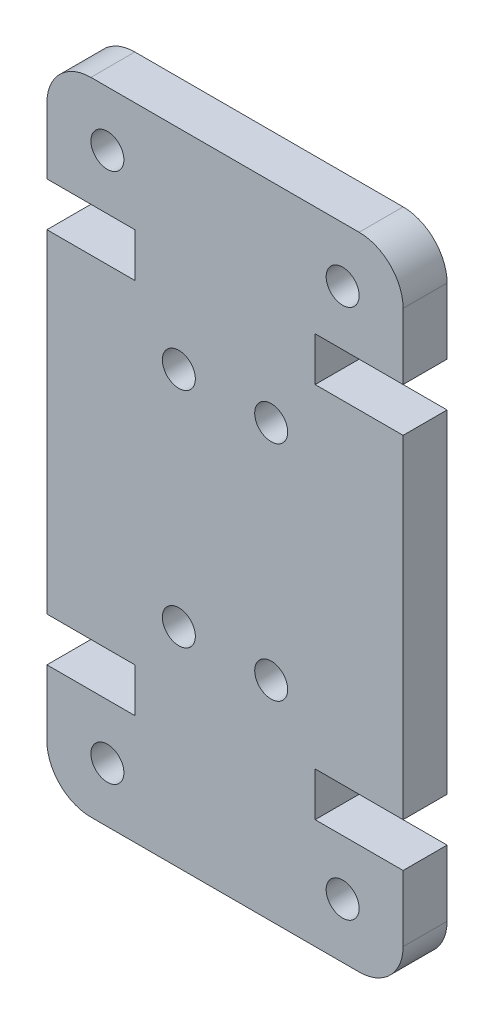
ISO-10303-21;
HEADER;
FILE_DESCRIPTION(('STEP AP214'),'2;1');
FILE_NAME('part.step','',(''),(''),'','','');
FILE_SCHEMA(('AUTOMOTIVE_DESIGN { 1 0 10303 214 1 1 1 1 }'));
ENDSEC;
DATA;
#1=APPLICATION_CONTEXT('core data for automotive mechanical design processes');
#2=APPLICATION_PROTOCOL_DEFINITION('international standard','automotive_design',2000,#1);
#3=PRODUCT_CONTEXT('',#1,'mechanical');
#4=PRODUCT('Part','Part','',(#3));
#5=PRODUCT_RELATED_PRODUCT_CATEGORY('part','',(#4));
#6=PRODUCT_DEFINITION_FORMATION('','',#4);
#7=PRODUCT_DEFINITION_CONTEXT('part definition',#1,'design');
#8=PRODUCT_DEFINITION('design','',#6,#7);
#9=PRODUCT_DEFINITION_SHAPE('','',#8);
#10=(LENGTH_UNIT() NAMED_UNIT(*) SI_UNIT(.MILLI.,.METRE.));
#11=(NAMED_UNIT(*) PLANE_ANGLE_UNIT() SI_UNIT($,.RADIAN.));
#12=(NAMED_UNIT(*) SI_UNIT($,.STERADIAN.) SOLID_ANGLE_UNIT());
#13=UNCERTAINTY_MEASURE_WITH_UNIT(LENGTH_MEASURE(1.E-05),#10,'distance_accuracy_value','');
#14=(GEOMETRIC_REPRESENTATION_CONTEXT(3) GLOBAL_UNCERTAINTY_ASSIGNED_CONTEXT((#13)) GLOBAL_UNIT_ASSIGNED_CONTEXT((#10,
#11,#12)) REPRESENTATION_CONTEXT('',''));
#15=CARTESIAN_POINT('',(0.,0.,0.));
#16=DIRECTION('',(0.,0.,1.));
#17=DIRECTION('',(1.,0.,0.));
#18=AXIS2_PLACEMENT_3D('',#15,#16,#17);
#19=CARTESIAN_POINT('',(2.00000000000002,2.,2.));
#20=DIRECTION('',(0.,0.,1.));
#21=DIRECTION('',(1.,0.,0.));
#22=AXIS2_PLACEMENT_3D('',#19,#20,#21);
#23=PLANE('',#22);
#24=CARTESIAN_POINT('',(10.2,19.6400000000004,2.));
#25=DIRECTION('',(0.,0.,1.));
#26=DIRECTION('',(1.,0.,0.));
#27=AXIS2_PLACEMENT_3D('',#24,#25,#26);
#28=CIRCLE('',#27,0.750000000000002);
#29=CARTESIAN_POINT('',(10.95,19.6400000000004,2.));
#30=VERTEX_POINT('',#29);
#31=EDGE_CURVE('E464',#30,#30,#28,.T.);
#32=ORIENTED_EDGE('',*,*,#31,.F.);
#33=EDGE_LOOP('',(#32));
#34=FACE_BOUND('',#33,.T.);
#35=CARTESIAN_POINT('',(6.,19.6400000000004,2.));
#36=DIRECTION('',(0.,0.,1.));
#37=DIRECTION('',(-1.,0.,0.));
#38=AXIS2_PLACEMENT_3D('',#35,#36,#37);
#39=CIRCLE('',#38,0.750000000000001);
#40=CARTESIAN_POINT('',(5.25,19.6400000000004,2.));
#41=VERTEX_POINT('',#40);
#42=EDGE_CURVE('E476',#41,#41,#39,.T.);
#43=ORIENTED_EDGE('',*,*,#42,.F.);
#44=EDGE_LOOP('',(#43));
#45=FACE_BOUND('',#44,.T.);
#46=CARTESIAN_POINT('',(2.75000000000004,26.6399999999998,2.));
#47=DIRECTION('',(0.,0.,1.));
#48=DIRECTION('',(-1.,0.,0.));
#49=AXIS2_PLACEMENT_3D('',#46,#47,#48);
#50=CIRCLE('',#49,0.750000000000001);
#51=CARTESIAN_POINT('',(2.00000000000004,26.6399999999998,2.));
#52=VERTEX_POINT('',#51);
#53=EDGE_CURVE('E488',#52,#52,#50,.T.);
#54=ORIENTED_EDGE('',*,*,#53,.F.);
#55=EDGE_LOOP('',(#54));
#56=FACE_BOUND('',#55,.T.);
#57=CARTESIAN_POINT('',(13.45,2.50000000000017,2.));
#58=DIRECTION('',(0.,0.,1.));
#59=DIRECTION('',(-1.,0.,0.));
#60=AXIS2_PLACEMENT_3D('',#57,#58,#59);
#61=CIRCLE('',#60,0.750000000000002);
#62=CARTESIAN_POINT('',(12.7,2.50000000000017,2.));
#63=VERTEX_POINT('',#62);
#64=EDGE_CURVE('E230',#63,#63,#61,.T.);
#65=ORIENTED_EDGE('',*,*,#64,.F.);
#66=EDGE_LOOP('',(#65));
#67=FACE_BOUND('',#66,.T.);
#68=DIRECTION('',(1.,0.,0.));
#69=VECTOR('',#68,1.);
#70=CARTESIAN_POINT('',(0.,6.99999999999946,2.));
#71=LINE('',#70,#69);
#72=CARTESIAN_POINT('',(0.,6.99999999999946,2.));
#73=VERTEX_POINT('',#72);
#74=CARTESIAN_POINT('',(4.00000000000002,6.99999999999946,2.));
#75=VERTEX_POINT('',#74);
#76=EDGE_CURVE('E273',#73,#75,#71,.T.);
#77=ORIENTED_EDGE('',*,*,#76,.T.);
#78=DIRECTION('',(0.,-1.,0.));
#79=VECTOR('',#78,1.);
#80=CARTESIAN_POINT('',(4.00000000000002,6.99999999999946,2.));
#81=LINE('',#80,#79);
#82=CARTESIAN_POINT('',(4.,4.99999999999945,2.));
#83=VERTEX_POINT('',#82);
#84=EDGE_CURVE('E141',#75,#83,#81,.T.);
#85=ORIENTED_EDGE('',*,*,#84,.T.);
#86=DIRECTION('',(-1.,0.,0.));
#87=VECTOR('',#86,1.);
#88=CARTESIAN_POINT('',(4.,4.99999999999945,2.));
#89=LINE('',#88,#87);
#90=CARTESIAN_POINT('',(0.,4.99999999999945,2.));
#91=VERTEX_POINT('',#90);
#92=EDGE_CURVE('E336',#83,#91,#89,.T.);
#93=ORIENTED_EDGE('',*,*,#92,.T.);
#94=DIRECTION('',(0.,-1.,0.));
#95=VECTOR('',#94,1.);
#96=CARTESIAN_POINT('',(0.,2.,2.));
#97=LINE('',#96,#95);
#98=CARTESIAN_POINT('',(0.,2.,2.));
#99=VERTEX_POINT('',#98);
#100=EDGE_CURVE('E355',#91,#99,#97,.T.);
#101=ORIENTED_EDGE('',*,*,#100,.T.);
#102=CARTESIAN_POINT('',(2.00000000000002,2.,2.));
#103=DIRECTION('',(0.,0.,1.));
#104=DIRECTION('',(1.,0.,0.));
#105=AXIS2_PLACEMENT_3D('',#102,#103,#104);
#106=CIRCLE('',#105,2.00000000000001);
#107=CARTESIAN_POINT('',(2.00000000000002,0.,2.));
#108=VERTEX_POINT('',#107);
#109=EDGE_CURVE('E352',#99,#108,#106,.T.);
#110=ORIENTED_EDGE('',*,*,#109,.T.);
#111=DIRECTION('',(1.,0.,0.));
#112=VECTOR('',#111,1.);
#113=CARTESIAN_POINT('',(2.00000000000002,0.,2.));
#114=LINE('',#113,#112);
#115=CARTESIAN_POINT('',(14.2,0.,2.));
#116=VERTEX_POINT('',#115);
#117=EDGE_CURVE('E354',#108,#116,#114,.T.);
#118=ORIENTED_EDGE('',*,*,#117,.T.);
#119=CARTESIAN_POINT('',(14.2,2.,2.));
#120=DIRECTION('',(0.,0.,1.));
#121=DIRECTION('',(-1.,0.,0.));
#122=AXIS2_PLACEMENT_3D('',#119,#120,#121);
#123=CIRCLE('',#122,2.);
#124=CARTESIAN_POINT('',(16.2,2.,2.));
#125=VERTEX_POINT('',#124);
#126=EDGE_CURVE('E357',#116,#125,#123,.T.);
#127=ORIENTED_EDGE('',*,*,#126,.T.);
#128=DIRECTION('',(0.,1.,0.));
#129=VECTOR('',#128,1.);
#130=CARTESIAN_POINT('',(16.2,2.,2.));
#131=LINE('',#130,#129);
#132=CARTESIAN_POINT('',(16.2,4.99999999999945,2.));
#133=VERTEX_POINT('',#132);
#134=EDGE_CURVE('E363',#125,#133,#131,.T.);
#135=ORIENTED_EDGE('',*,*,#134,.T.);
#136=DIRECTION('',(-1.,0.,0.));
#137=VECTOR('',#136,1.);
#138=CARTESIAN_POINT('',(12.2,4.99999999999945,2.));
#139=LINE('',#138,#137);
#140=CARTESIAN_POINT('',(12.2,4.99999999999945,2.));
#141=VERTEX_POINT('',#140);
#142=EDGE_CURVE('E365',#133,#141,#139,.T.);
#143=ORIENTED_EDGE('',*,*,#142,.T.);
#144=DIRECTION('',(0.,1.,0.));
#145=VECTOR('',#144,1.);
#146=CARTESIAN_POINT('',(12.2,6.99999999999945,2.));
#147=LINE('',#146,#145);
#148=CARTESIAN_POINT('',(12.2,6.99999999999945,2.));
#149=VERTEX_POINT('',#148);
#150=EDGE_CURVE('E367',#141,#149,#147,.T.);
#151=ORIENTED_EDGE('',*,*,#150,.T.);
#152=DIRECTION('',(1.,0.,0.));
#153=VECTOR('',#152,1.);
#154=CARTESIAN_POINT('',(16.2,6.99999999999945,2.));
#155=LINE('',#154,#153);
#156=CARTESIAN_POINT('',(16.2,6.99999999999945,2.));
#157=VERTEX_POINT('',#156);
#158=EDGE_CURVE('E369',#149,#157,#155,.T.);
#159=ORIENTED_EDGE('',*,*,#158,.T.);
#160=DIRECTION('',(0.,1.,0.));
#161=VECTOR('',#160,1.);
#162=CARTESIAN_POINT('',(16.2,22.1400000000005,2.));
#163=LINE('',#162,#161);
#164=CARTESIAN_POINT('',(16.2,22.1400000000005,2.));
#165=VERTEX_POINT('',#164);
#166=EDGE_CURVE('E371',#157,#165,#163,.T.);
#167=ORIENTED_EDGE('',*,*,#166,.T.);
#168=DIRECTION('',(-1.,0.,0.));
#169=VECTOR('',#168,1.);
#170=CARTESIAN_POINT('',(16.2,22.1400000000005,2.));
#171=LINE('',#170,#169);
#172=CARTESIAN_POINT('',(12.2,22.1400000000005,2.));
#173=VERTEX_POINT('',#172);
#174=EDGE_CURVE('E373',#165,#173,#171,.T.);
#175=ORIENTED_EDGE('',*,*,#174,.T.);
#176=DIRECTION('',(0.,1.,0.));
#177=VECTOR('',#176,1.);
#178=CARTESIAN_POINT('',(12.2,22.1400000000005,2.));
#179=LINE('',#178,#177);
#180=CARTESIAN_POINT('',(12.2,24.1400000000006,2.));
#181=VERTEX_POINT('',#180);
#182=EDGE_CURVE('E375',#173,#181,#179,.T.);
#183=ORIENTED_EDGE('',*,*,#182,.T.);
#184=DIRECTION('',(1.,0.,0.));
#185=VECTOR('',#184,1.);
#186=CARTESIAN_POINT('',(12.2,24.1400000000006,2.));
#187=LINE('',#186,#185);
#188=CARTESIAN_POINT('',(16.2,24.1400000000006,2.));
#189=VERTEX_POINT('',#188);
#190=EDGE_CURVE('E377',#181,#189,#187,.T.);
#191=ORIENTED_EDGE('',*,*,#190,.T.);
#192=DIRECTION('',(0.,1.,0.));
#193=VECTOR('',#192,1.);
#194=CARTESIAN_POINT('',(16.2,27.14,2.));
#195=LINE('',#194,#193);
#196=CARTESIAN_POINT('',(16.2,27.14,2.));
#197=VERTEX_POINT('',#196);
#198=EDGE_CURVE('E379',#189,#197,#195,.T.);
#199=ORIENTED_EDGE('',*,*,#198,.T.);
#200=CARTESIAN_POINT('',(14.2,27.14,2.));
#201=DIRECTION('',(0.,0.,1.));
#202=DIRECTION('',(1.,0.,0.));
#203=AXIS2_PLACEMENT_3D('',#200,#201,#202);
#204=CIRCLE('',#203,2.);
#205=CARTESIAN_POINT('',(14.2,29.14,2.));
#206=VERTEX_POINT('',#205);
#207=EDGE_CURVE('E381',#197,#206,#204,.T.);
#208=ORIENTED_EDGE('',*,*,#207,.T.);
#209=DIRECTION('',(-1.,0.,0.));
#210=VECTOR('',#209,1.);
#211=CARTESIAN_POINT('',(1.99999999999999,29.14,2.));
#212=LINE('',#211,#210);
#213=CARTESIAN_POINT('',(1.99999999999999,29.14,2.));
#214=VERTEX_POINT('',#213);
#215=EDGE_CURVE('E383',#206,#214,#212,.T.);
#216=ORIENTED_EDGE('',*,*,#215,.T.);
#217=CARTESIAN_POINT('',(2.,27.14,2.));
#218=DIRECTION('',(0.,0.,1.));
#219=DIRECTION('',(-1.,0.,0.));
#220=AXIS2_PLACEMENT_3D('',#217,#218,#219);
#221=CIRCLE('',#220,2.);
#222=CARTESIAN_POINT('',(0.,27.14,2.));
#223=VERTEX_POINT('',#222);
#224=EDGE_CURVE('E385',#214,#223,#221,.T.);
#225=ORIENTED_EDGE('',*,*,#224,.T.);
#226=DIRECTION('',(0.,-1.,0.));
#227=VECTOR('',#226,1.);
#228=CARTESIAN_POINT('',(0.,27.14,2.));
#229=LINE('',#228,#227);
#230=CARTESIAN_POINT('',(0.,24.1400000000005,2.));
#231=VERTEX_POINT('',#230);
#232=EDGE_CURVE('E387',#223,#231,#229,.T.);
#233=ORIENTED_EDGE('',*,*,#232,.T.);
#234=DIRECTION('',(1.,0.,0.));
#235=VECTOR('',#234,1.);
#236=CARTESIAN_POINT('',(3.99999999999999,24.1400000000006,2.));
#237=LINE('',#236,#235);
#238=CARTESIAN_POINT('',(3.99999999999999,24.1400000000006,2.));
#239=VERTEX_POINT('',#238);
#240=EDGE_CURVE('E208',#231,#239,#237,.T.);
#241=ORIENTED_EDGE('',*,*,#240,.T.);
#242=DIRECTION('',(0.,-1.,0.));
#243=VECTOR('',#242,1.);
#244=CARTESIAN_POINT('',(4.,22.1400000000005,2.));
#245=LINE('',#244,#243);
#246=CARTESIAN_POINT('',(4.,22.1400000000005,2.));
#247=VERTEX_POINT('',#246);
#248=EDGE_CURVE('E202',#239,#247,#245,.T.);
#249=ORIENTED_EDGE('',*,*,#248,.T.);
#250=DIRECTION('',(-1.,0.,0.));
#251=VECTOR('',#250,1.);
#252=CARTESIAN_POINT('',(0.,22.1400000000005,2.));
#253=LINE('',#252,#251);
#254=CARTESIAN_POINT('',(0.,22.1400000000005,2.));
#255=VERTEX_POINT('',#254);
#256=EDGE_CURVE('E206',#247,#255,#253,.T.);
#257=ORIENTED_EDGE('',*,*,#256,.T.);
#258=DIRECTION('',(0.,-1.,0.));
#259=VECTOR('',#258,1.);
#260=CARTESIAN_POINT('',(0.,22.1400000000005,2.));
#261=LINE('',#260,#259);
#262=EDGE_CURVE('E50',#255,#73,#261,.T.);
#263=ORIENTED_EDGE('',*,*,#262,.T.);
#264=EDGE_LOOP('',(#77,#85,#93,#101,#110,#118,#127,#135,#143,#151,#159,#167,#175,#183,#191,#199,
#208,#216,#225,#233,#241,#249,#257,#263));
#265=FACE_BOUND('',#264,.T.);
#266=CARTESIAN_POINT('',(10.2,9.49999999999962,2.));
#267=DIRECTION('',(0.,0.,1.));
#268=DIRECTION('',(-1.,0.,0.));
#269=AXIS2_PLACEMENT_3D('',#266,#267,#268);
#270=CIRCLE('',#269,0.750000000000002);
#271=CARTESIAN_POINT('',(9.44999999999999,9.49999999999962,2.));
#272=VERTEX_POINT('',#271);
#273=EDGE_CURVE('E494',#272,#272,#270,.T.);
#274=ORIENTED_EDGE('',*,*,#273,.F.);
#275=EDGE_LOOP('',(#274));
#276=FACE_BOUND('',#275,.T.);
#277=CARTESIAN_POINT('',(6.00000000000001,9.49999999999962,2.));
#278=DIRECTION('',(0.,0.,1.));
#279=DIRECTION('',(1.,0.,0.));
#280=AXIS2_PLACEMENT_3D('',#277,#278,#279);
#281=CIRCLE('',#280,0.75);
#282=CARTESIAN_POINT('',(6.75000000000001,9.49999999999962,2.));
#283=VERTEX_POINT('',#282);
#284=EDGE_CURVE('E482',#283,#283,#281,.T.);
#285=ORIENTED_EDGE('',*,*,#284,.F.);
#286=EDGE_LOOP('',(#285));
#287=FACE_BOUND('',#286,.T.);
#288=CARTESIAN_POINT('',(2.75000000000004,2.50000000000017,2.));
#289=DIRECTION('',(0.,0.,1.));
#290=DIRECTION('',(1.,0.,0.));
#291=AXIS2_PLACEMENT_3D('',#288,#289,#290);
#292=CIRCLE('',#291,0.75);
#293=CARTESIAN_POINT('',(3.50000000000004,2.50000000000017,2.));
#294=VERTEX_POINT('',#293);
#295=EDGE_CURVE('E470',#294,#294,#292,.T.);
#296=ORIENTED_EDGE('',*,*,#295,.F.);
#297=EDGE_LOOP('',(#296));
#298=FACE_BOUND('',#297,.T.);
#299=CARTESIAN_POINT('',(13.45,26.6399999999998,2.));
#300=DIRECTION('',(0.,0.,1.));
#301=DIRECTION('',(1.,0.,0.));
#302=AXIS2_PLACEMENT_3D('',#299,#300,#301);
#303=CIRCLE('',#302,0.750000000000002);
#304=CARTESIAN_POINT('',(14.2,26.6399999999998,2.));
#305=VERTEX_POINT('',#304);
#306=EDGE_CURVE('E455',#305,#305,#303,.T.);
#307=ORIENTED_EDGE('',*,*,#306,.F.);
#308=EDGE_LOOP('',(#307));
#309=FACE_BOUND('',#308,.T.);
#310=ADVANCED_FACE('F33',(#34,#45,#56,#67,#265,#276,#287,#298,#309),#23,.T.);
#311=CARTESIAN_POINT('',(2.00000000000002,2.,0.));
#312=DIRECTION('',(0.,0.,1.));
#313=DIRECTION('',(1.,0.,0.));
#314=AXIS2_PLACEMENT_3D('',#311,#312,#313);
#315=PLANE('',#314);
#316=CARTESIAN_POINT('',(10.2,19.6400000000004,0.));
#317=DIRECTION('',(0.,0.,1.));
#318=DIRECTION('',(1.,0.,0.));
#319=AXIS2_PLACEMENT_3D('',#316,#317,#318);
#320=CIRCLE('',#319,0.750000000000002);
#321=CARTESIAN_POINT('',(10.95,19.6400000000004,0.));
#322=VERTEX_POINT('',#321);
#323=EDGE_CURVE('E461',#322,#322,#320,.T.);
#324=ORIENTED_EDGE('',*,*,#323,.T.);
#325=EDGE_LOOP('',(#324));
#326=FACE_BOUND('',#325,.T.);
#327=CARTESIAN_POINT('',(6.,19.6400000000004,0.));
#328=DIRECTION('',(0.,0.,1.));
#329=DIRECTION('',(-1.,0.,0.));
#330=AXIS2_PLACEMENT_3D('',#327,#328,#329);
#331=CIRCLE('',#330,0.750000000000001);
#332=CARTESIAN_POINT('',(5.25,19.6400000000004,0.));
#333=VERTEX_POINT('',#332);
#334=EDGE_CURVE('E473',#333,#333,#331,.T.);
#335=ORIENTED_EDGE('',*,*,#334,.T.);
#336=EDGE_LOOP('',(#335));
#337=FACE_BOUND('',#336,.T.);
#338=CARTESIAN_POINT('',(2.75000000000004,26.6399999999998,0.));
#339=DIRECTION('',(0.,0.,1.));
#340=DIRECTION('',(-1.,0.,0.));
#341=AXIS2_PLACEMENT_3D('',#338,#339,#340);
#342=CIRCLE('',#341,0.750000000000001);
#343=CARTESIAN_POINT('',(2.00000000000004,26.6399999999998,0.));
#344=VERTEX_POINT('',#343);
#345=EDGE_CURVE('E485',#344,#344,#342,.T.);
#346=ORIENTED_EDGE('',*,*,#345,.T.);
#347=EDGE_LOOP('',(#346));
#348=FACE_BOUND('',#347,.T.);
#349=CARTESIAN_POINT('',(13.45,2.50000000000017,0.));
#350=DIRECTION('',(0.,0.,1.));
#351=DIRECTION('',(-1.,0.,0.));
#352=AXIS2_PLACEMENT_3D('',#349,#350,#351);
#353=CIRCLE('',#352,0.750000000000002);
#354=CARTESIAN_POINT('',(12.7,2.50000000000017,0.));
#355=VERTEX_POINT('',#354);
#356=EDGE_CURVE('E497',#355,#355,#353,.T.);
#357=ORIENTED_EDGE('',*,*,#356,.T.);
#358=EDGE_LOOP('',(#357));
#359=FACE_BOUND('',#358,.T.);
#360=DIRECTION('',(1.,0.,0.));
#361=VECTOR('',#360,1.);
#362=CARTESIAN_POINT('',(0.,6.99999999999946,0.));
#363=LINE('',#362,#361);
#364=CARTESIAN_POINT('',(0.,6.99999999999946,0.));
#365=VERTEX_POINT('',#364);
#366=CARTESIAN_POINT('',(4.00000000000002,6.99999999999946,0.));
#367=VERTEX_POINT('',#366);
#368=EDGE_CURVE('E226',#365,#367,#363,.T.);
#369=ORIENTED_EDGE('',*,*,#368,.F.);
#370=DIRECTION('',(0.,-1.,0.));
#371=VECTOR('',#370,1.);
#372=CARTESIAN_POINT('',(0.,22.1400000000005,0.));
#373=LINE('',#372,#371);
#374=CARTESIAN_POINT('',(0.,22.1400000000005,0.));
#375=VERTEX_POINT('',#374);
#376=EDGE_CURVE('E133',#375,#365,#373,.T.);
#377=ORIENTED_EDGE('',*,*,#376,.F.);
#378=DIRECTION('',(-1.,0.,0.));
#379=VECTOR('',#378,1.);
#380=CARTESIAN_POINT('',(0.,22.1400000000005,0.));
#381=LINE('',#380,#379);
#382=CARTESIAN_POINT('',(4.,22.1400000000005,0.));
#383=VERTEX_POINT('',#382);
#384=EDGE_CURVE('E127',#383,#375,#381,.T.);
#385=ORIENTED_EDGE('',*,*,#384,.F.);
#386=DIRECTION('',(0.,-1.,0.));
#387=VECTOR('',#386,1.);
#388=CARTESIAN_POINT('',(4.,22.1400000000005,0.));
#389=LINE('',#388,#387);
#390=CARTESIAN_POINT('',(3.99999999999999,24.1400000000006,0.));
#391=VERTEX_POINT('',#390);
#392=EDGE_CURVE('E216',#391,#383,#389,.T.);
#393=ORIENTED_EDGE('',*,*,#392,.F.);
#394=DIRECTION('',(1.,0.,0.));
#395=VECTOR('',#394,1.);
#396=CARTESIAN_POINT('',(3.99999999999999,24.1400000000006,0.));
#397=LINE('',#396,#395);
#398=CARTESIAN_POINT('',(0.,24.1400000000005,0.));
#399=VERTEX_POINT('',#398);
#400=EDGE_CURVE('E268',#399,#391,#397,.T.);
#401=ORIENTED_EDGE('',*,*,#400,.F.);
#402=DIRECTION('',(0.,-1.,0.));
#403=VECTOR('',#402,1.);
#404=CARTESIAN_POINT('',(0.,27.14,0.));
#405=LINE('',#404,#403);
#406=CARTESIAN_POINT('',(0.,27.14,0.));
#407=VERTEX_POINT('',#406);
#408=EDGE_CURVE('E266',#407,#399,#405,.T.);
#409=ORIENTED_EDGE('',*,*,#408,.F.);
#410=CARTESIAN_POINT('',(2.,27.14,0.));
#411=DIRECTION('',(0.,0.,1.));
#412=DIRECTION('',(-1.,0.,0.));
#413=AXIS2_PLACEMENT_3D('',#410,#411,#412);
#414=CIRCLE('',#413,2.);
#415=CARTESIAN_POINT('',(1.99999999999999,29.14,0.));
#416=VERTEX_POINT('',#415);
#417=EDGE_CURVE('E264',#416,#407,#414,.T.);
#418=ORIENTED_EDGE('',*,*,#417,.F.);
#419=DIRECTION('',(-1.,0.,0.));
#420=VECTOR('',#419,1.);
#421=CARTESIAN_POINT('',(1.99999999999999,29.14,0.));
#422=LINE('',#421,#420);
#423=CARTESIAN_POINT('',(14.2,29.14,0.));
#424=VERTEX_POINT('',#423);
#425=EDGE_CURVE('E262',#424,#416,#422,.T.);
#426=ORIENTED_EDGE('',*,*,#425,.F.);
#427=CARTESIAN_POINT('',(14.2,27.14,0.));
#428=DIRECTION('',(0.,0.,1.));
#429=DIRECTION('',(1.,0.,0.));
#430=AXIS2_PLACEMENT_3D('',#427,#428,#429);
#431=CIRCLE('',#430,2.);
#432=CARTESIAN_POINT('',(16.2,27.14,0.));
#433=VERTEX_POINT('',#432);
#434=EDGE_CURVE('E260',#433,#424,#431,.T.);
#435=ORIENTED_EDGE('',*,*,#434,.F.);
#436=DIRECTION('',(0.,1.,0.));
#437=VECTOR('',#436,1.);
#438=CARTESIAN_POINT('',(16.2,27.14,0.));
#439=LINE('',#438,#437);
#440=CARTESIAN_POINT('',(16.2,24.1400000000006,0.));
#441=VERTEX_POINT('',#440);
#442=EDGE_CURVE('E258',#441,#433,#439,.T.);
#443=ORIENTED_EDGE('',*,*,#442,.F.);
#444=DIRECTION('',(1.,0.,0.));
#445=VECTOR('',#444,1.);
#446=CARTESIAN_POINT('',(12.2,24.1400000000006,0.));
#447=LINE('',#446,#445);
#448=CARTESIAN_POINT('',(12.2,24.1400000000006,0.));
#449=VERTEX_POINT('',#448);
#450=EDGE_CURVE('E256',#449,#441,#447,.T.);
#451=ORIENTED_EDGE('',*,*,#450,.F.);
#452=DIRECTION('',(0.,1.,0.));
#453=VECTOR('',#452,1.);
#454=CARTESIAN_POINT('',(12.2,22.1400000000005,0.));
#455=LINE('',#454,#453);
#456=CARTESIAN_POINT('',(12.2,22.1400000000005,0.));
#457=VERTEX_POINT('',#456);
#458=EDGE_CURVE('E254',#457,#449,#455,.T.);
#459=ORIENTED_EDGE('',*,*,#458,.F.);
#460=DIRECTION('',(-1.,0.,0.));
#461=VECTOR('',#460,1.);
#462=CARTESIAN_POINT('',(16.2,22.1400000000005,0.));
#463=LINE('',#462,#461);
#464=CARTESIAN_POINT('',(16.2,22.1400000000005,0.));
#465=VERTEX_POINT('',#464);
#466=EDGE_CURVE('E252',#465,#457,#463,.T.);
#467=ORIENTED_EDGE('',*,*,#466,.F.);
#468=DIRECTION('',(0.,1.,0.));
#469=VECTOR('',#468,1.);
#470=CARTESIAN_POINT('',(16.2,22.1400000000005,0.));
#471=LINE('',#470,#469);
#472=CARTESIAN_POINT('',(16.2,6.99999999999945,0.));
#473=VERTEX_POINT('',#472);
#474=EDGE_CURVE('E250',#473,#465,#471,.T.);
#475=ORIENTED_EDGE('',*,*,#474,.F.);
#476=DIRECTION('',(1.,0.,0.));
#477=VECTOR('',#476,1.);
#478=CARTESIAN_POINT('',(16.2,6.99999999999945,0.));
#479=LINE('',#478,#477);
#480=CARTESIAN_POINT('',(12.2,6.99999999999945,0.));
#481=VERTEX_POINT('',#480);
#482=EDGE_CURVE('E248',#481,#473,#479,.T.);
#483=ORIENTED_EDGE('',*,*,#482,.F.);
#484=DIRECTION('',(0.,1.,0.));
#485=VECTOR('',#484,1.);
#486=CARTESIAN_POINT('',(12.2,6.99999999999945,0.));
#487=LINE('',#486,#485);
#488=CARTESIAN_POINT('',(12.2,4.99999999999945,0.));
#489=VERTEX_POINT('',#488);
#490=EDGE_CURVE('E246',#489,#481,#487,.T.);
#491=ORIENTED_EDGE('',*,*,#490,.F.);
#492=DIRECTION('',(-1.,0.,0.));
#493=VECTOR('',#492,1.);
#494=CARTESIAN_POINT('',(12.2,4.99999999999945,0.));
#495=LINE('',#494,#493);
#496=CARTESIAN_POINT('',(16.2,4.99999999999945,0.));
#497=VERTEX_POINT('',#496);
#498=EDGE_CURVE('E244',#497,#489,#495,.T.);
#499=ORIENTED_EDGE('',*,*,#498,.F.);
#500=DIRECTION('',(0.,1.,0.));
#501=VECTOR('',#500,1.);
#502=CARTESIAN_POINT('',(16.2,2.,0.));
#503=LINE('',#502,#501);
#504=CARTESIAN_POINT('',(16.2,2.,0.));
#505=VERTEX_POINT('',#504);
#506=EDGE_CURVE('E242',#505,#497,#503,.T.);
#507=ORIENTED_EDGE('',*,*,#506,.F.);
#508=CARTESIAN_POINT('',(14.2,2.,0.));
#509=DIRECTION('',(0.,0.,1.));
#510=DIRECTION('',(-1.,0.,0.));
#511=AXIS2_PLACEMENT_3D('',#508,#509,#510);
#512=CIRCLE('',#511,2.);
#513=CARTESIAN_POINT('',(14.2,0.,0.));
#514=VERTEX_POINT('',#513);
#515=EDGE_CURVE('E240',#514,#505,#512,.T.);
#516=ORIENTED_EDGE('',*,*,#515,.F.);
#517=DIRECTION('',(1.,0.,0.));
#518=VECTOR('',#517,1.);
#519=CARTESIAN_POINT('',(2.00000000000002,0.,0.));
#520=LINE('',#519,#518);
#521=CARTESIAN_POINT('',(2.00000000000002,0.,0.));
#522=VERTEX_POINT('',#521);
#523=EDGE_CURVE('E238',#522,#514,#520,.T.);
#524=ORIENTED_EDGE('',*,*,#523,.F.);
#525=CARTESIAN_POINT('',(2.00000000000002,2.,0.));
#526=DIRECTION('',(0.,0.,1.));
#527=DIRECTION('',(1.,0.,0.));
#528=AXIS2_PLACEMENT_3D('',#525,#526,#527);
#529=CIRCLE('',#528,2.00000000000001);
#530=CARTESIAN_POINT('',(0.,2.,0.));
#531=VERTEX_POINT('',#530);
#532=EDGE_CURVE('E236',#531,#522,#529,.T.);
#533=ORIENTED_EDGE('',*,*,#532,.F.);
#534=DIRECTION('',(0.,-1.,0.));
#535=VECTOR('',#534,1.);
#536=CARTESIAN_POINT('',(0.,2.,0.));
#537=LINE('',#536,#535);
#538=CARTESIAN_POINT('',(0.,4.99999999999945,0.));
#539=VERTEX_POINT('',#538);
#540=EDGE_CURVE('E234',#539,#531,#537,.T.);
#541=ORIENTED_EDGE('',*,*,#540,.F.);
#542=DIRECTION('',(-1.,0.,0.));
#543=VECTOR('',#542,1.);
#544=CARTESIAN_POINT('',(4.,4.99999999999945,0.));
#545=LINE('',#544,#543);
#546=CARTESIAN_POINT('',(4.,4.99999999999945,0.));
#547=VERTEX_POINT('',#546);
#548=EDGE_CURVE('E232',#547,#539,#545,.T.);
#549=ORIENTED_EDGE('',*,*,#548,.F.);
#550=DIRECTION('',(0.,-1.,0.));
#551=VECTOR('',#550,1.);
#552=CARTESIAN_POINT('',(4.00000000000002,6.99999999999946,0.));
#553=LINE('',#552,#551);
#554=EDGE_CURVE('E229',#367,#547,#553,.T.);
#555=ORIENTED_EDGE('',*,*,#554,.F.);
#556=EDGE_LOOP('',(#369,#377,#385,#393,#401,#409,#418,#426,#435,#443,#451,#459,#467,#475,#483,
#491,#499,#507,#516,#524,#533,#541,#549,#555));
#557=FACE_BOUND('',#556,.T.);
#558=CARTESIAN_POINT('',(10.2,9.49999999999962,0.));
#559=DIRECTION('',(0.,0.,1.));
#560=DIRECTION('',(-1.,0.,0.));
#561=AXIS2_PLACEMENT_3D('',#558,#559,#560);
#562=CIRCLE('',#561,0.750000000000002);
#563=CARTESIAN_POINT('',(9.44999999999999,9.49999999999962,0.));
#564=VERTEX_POINT('',#563);
#565=EDGE_CURVE('E491',#564,#564,#562,.T.);
#566=ORIENTED_EDGE('',*,*,#565,.T.);
#567=EDGE_LOOP('',(#566));
#568=FACE_BOUND('',#567,.T.);
#569=CARTESIAN_POINT('',(6.00000000000001,9.49999999999962,0.));
#570=DIRECTION('',(0.,0.,1.));
#571=DIRECTION('',(1.,0.,0.));
#572=AXIS2_PLACEMENT_3D('',#569,#570,#571);
#573=CIRCLE('',#572,0.75);
#574=CARTESIAN_POINT('',(6.75000000000001,9.49999999999962,0.));
#575=VERTEX_POINT('',#574);
#576=EDGE_CURVE('E479',#575,#575,#573,.T.);
#577=ORIENTED_EDGE('',*,*,#576,.T.);
#578=EDGE_LOOP('',(#577));
#579=FACE_BOUND('',#578,.T.);
#580=CARTESIAN_POINT('',(2.75000000000004,2.50000000000017,0.));
#581=DIRECTION('',(0.,0.,1.));
#582=DIRECTION('',(1.,0.,0.));
#583=AXIS2_PLACEMENT_3D('',#580,#581,#582);
#584=CIRCLE('',#583,0.75);
#585=CARTESIAN_POINT('',(3.50000000000004,2.50000000000017,0.));
#586=VERTEX_POINT('',#585);
#587=EDGE_CURVE('E467',#586,#586,#584,.T.);
#588=ORIENTED_EDGE('',*,*,#587,.T.);
#589=EDGE_LOOP('',(#588));
#590=FACE_BOUND('',#589,.T.);
#591=CARTESIAN_POINT('',(13.45,26.6399999999998,0.));
#592=DIRECTION('',(0.,0.,1.));
#593=DIRECTION('',(1.,0.,0.));
#594=AXIS2_PLACEMENT_3D('',#591,#592,#593);
#595=CIRCLE('',#594,0.750000000000002);
#596=CARTESIAN_POINT('',(14.2,26.6399999999998,0.));
#597=VERTEX_POINT('',#596);
#598=EDGE_CURVE('E458',#597,#597,#595,.T.);
#599=ORIENTED_EDGE('',*,*,#598,.T.);
#600=EDGE_LOOP('',(#599));
#601=FACE_BOUND('',#600,.T.);
#602=ADVANCED_FACE('F340',(#326,#337,#348,#359,#557,#568,#579,#590,#601),#315,.F.);
#603=CARTESIAN_POINT('',(0.,6.99999999999946,2.));
#604=DIRECTION('',(0.,1.,0.));
#605=DIRECTION('',(0.,0.,1.));
#606=AXIS2_PLACEMENT_3D('',#603,#604,#605);
#607=PLANE('',#606);
#608=ORIENTED_EDGE('',*,*,#368,.T.);
#609=DIRECTION('',(0.,0.,-1.));
#610=VECTOR('',#609,1.);
#611=CARTESIAN_POINT('',(4.00000000000002,6.99999999999946,2.));
#612=LINE('',#611,#610);
#613=EDGE_CURVE('E11',#75,#367,#612,.T.);
#614=ORIENTED_EDGE('',*,*,#613,.F.);
#615=ORIENTED_EDGE('',*,*,#76,.F.);
#616=DIRECTION('',(0.,0.,-1.));
#617=VECTOR('',#616,1.);
#618=CARTESIAN_POINT('',(0.,6.99999999999946,2.));
#619=LINE('',#618,#617);
#620=EDGE_CURVE('E222',#73,#365,#619,.T.);
#621=ORIENTED_EDGE('',*,*,#620,.T.);
#622=EDGE_LOOP('',(#608,#614,#615,#621));
#623=FACE_BOUND('',#622,.T.);
#624=ADVANCED_FACE('F35',(#623),#607,.F.);
#625=CARTESIAN_POINT('',(4.00000000000002,6.99999999999946,2.));
#626=DIRECTION('',(1.,0.,0.));
#627=DIRECTION('',(0.,1.,0.));
#628=AXIS2_PLACEMENT_3D('',#625,#626,#627);
#629=PLANE('',#628);
#630=ORIENTED_EDGE('',*,*,#554,.T.);
#631=DIRECTION('',(0.,0.,-1.));
#632=VECTOR('',#631,1.);
#633=CARTESIAN_POINT('',(4.,4.99999999999945,2.));
#634=LINE('',#633,#632);
#635=EDGE_CURVE('E42',#83,#547,#634,.T.);
#636=ORIENTED_EDGE('',*,*,#635,.F.);
#637=ORIENTED_EDGE('',*,*,#84,.F.);
#638=ORIENTED_EDGE('',*,*,#613,.T.);
#639=EDGE_LOOP('',(#630,#636,#637,#638));
#640=FACE_BOUND('',#639,.T.);
#641=ADVANCED_FACE('F762',(#640),#629,.F.);
#642=CARTESIAN_POINT('',(4.,4.99999999999945,2.));
#643=DIRECTION('',(0.,-1.,0.));
#644=DIRECTION('',(0.,0.,-1.));
#645=AXIS2_PLACEMENT_3D('',#642,#643,#644);
#646=PLANE('',#645);
#647=ORIENTED_EDGE('',*,*,#548,.T.);
#648=DIRECTION('',(0.,0.,-1.));
#649=VECTOR('',#648,1.);
#650=CARTESIAN_POINT('',(0.,4.99999999999945,2.));
#651=LINE('',#650,#649);
#652=EDGE_CURVE('E328',#91,#539,#651,.T.);
#653=ORIENTED_EDGE('',*,*,#652,.F.);
#654=ORIENTED_EDGE('',*,*,#92,.F.);
#655=ORIENTED_EDGE('',*,*,#635,.T.);
#656=EDGE_LOOP('',(#647,#653,#654,#655));
#657=FACE_BOUND('',#656,.T.);
#658=ADVANCED_FACE('F334',(#657),#646,.F.);
#659=CARTESIAN_POINT('',(0.,2.,2.));
#660=DIRECTION('',(1.,0.,0.));
#661=DIRECTION('',(0.,0.,-1.));
#662=AXIS2_PLACEMENT_3D('',#659,#660,#661);
#663=PLANE('',#662);
#664=ORIENTED_EDGE('',*,*,#540,.T.);
#665=DIRECTION('',(0.,0.,-1.));
#666=VECTOR('',#665,1.);
#667=CARTESIAN_POINT('',(0.,2.,2.));
#668=LINE('',#667,#666);
#669=EDGE_CURVE('E325',#99,#531,#668,.T.);
#670=ORIENTED_EDGE('',*,*,#669,.F.);
#671=ORIENTED_EDGE('',*,*,#100,.F.);
#672=ORIENTED_EDGE('',*,*,#652,.T.);
#673=EDGE_LOOP('',(#664,#670,#671,#672));
#674=FACE_BOUND('',#673,.T.);
#675=ADVANCED_FACE('F346',(#674),#663,.F.);
#676=CARTESIAN_POINT('',(2.00000000000002,2.,2.));
#677=DIRECTION('',(0.,0.,-1.));
#678=DIRECTION('',(-1.,0.,0.));
#679=AXIS2_PLACEMENT_3D('',#676,#677,#678);
#680=CYLINDRICAL_SURFACE('',#679,2.00000000000001);
#681=ORIENTED_EDGE('',*,*,#532,.T.);
#682=DIRECTION('',(0.,0.,-1.));
#683=VECTOR('',#682,1.);
#684=CARTESIAN_POINT('',(2.00000000000002,0.,2.));
#685=LINE('',#684,#683);
#686=EDGE_CURVE('E322',#108,#522,#685,.T.);
#687=ORIENTED_EDGE('',*,*,#686,.F.);
#688=ORIENTED_EDGE('',*,*,#109,.F.);
#689=ORIENTED_EDGE('',*,*,#669,.T.);
#690=EDGE_LOOP('',(#681,#687,#688,#689));
#691=FACE_BOUND('',#690,.T.);
#692=ADVANCED_FACE('F350',(#691),#680,.T.);
#693=CARTESIAN_POINT('',(2.00000000000002,0.,2.));
#694=DIRECTION('',(0.,1.,0.));
#695=DIRECTION('',(-1.,0.,0.));
#696=AXIS2_PLACEMENT_3D('',#693,#694,#695);
#697=PLANE('',#696);
#698=ORIENTED_EDGE('',*,*,#523,.T.);
#699=DIRECTION('',(0.,0.,-1.));
#700=VECTOR('',#699,1.);
#701=CARTESIAN_POINT('',(14.2,0.,2.));
#702=LINE('',#701,#700);
#703=EDGE_CURVE('E319',#116,#514,#702,.T.);
#704=ORIENTED_EDGE('',*,*,#703,.F.);
#705=ORIENTED_EDGE('',*,*,#117,.F.);
#706=ORIENTED_EDGE('',*,*,#686,.T.);
#707=EDGE_LOOP('',(#698,#704,#705,#706));
#708=FACE_BOUND('',#707,.T.);
#709=ADVANCED_FACE('F727',(#708),#697,.F.);
#710=CARTESIAN_POINT('',(14.2,2.,2.));
#711=DIRECTION('',(0.,0.,-1.));
#712=DIRECTION('',(-1.,0.,0.));
#713=AXIS2_PLACEMENT_3D('',#710,#711,#712);
#714=CYLINDRICAL_SURFACE('',#713,2.);
#715=ORIENTED_EDGE('',*,*,#515,.T.);
#716=DIRECTION('',(0.,0.,-1.));
#717=VECTOR('',#716,1.);
#718=CARTESIAN_POINT('',(16.2,2.,2.));
#719=LINE('',#718,#717);
#720=EDGE_CURVE('E316',#125,#505,#719,.T.);
#721=ORIENTED_EDGE('',*,*,#720,.F.);
#722=ORIENTED_EDGE('',*,*,#126,.F.);
#723=ORIENTED_EDGE('',*,*,#703,.T.);
#724=EDGE_LOOP('',(#715,#721,#722,#723));
#725=FACE_BOUND('',#724,.T.);
#726=ADVANCED_FACE('F717',(#725),#714,.T.);
#727=CARTESIAN_POINT('',(16.2,2.,2.));
#728=DIRECTION('',(-1.,0.,0.));
#729=DIRECTION('',(0.,0.,1.));
#730=AXIS2_PLACEMENT_3D('',#727,#728,#729);
#731=PLANE('',#730);
#732=ORIENTED_EDGE('',*,*,#506,.T.);
#733=DIRECTION('',(0.,0.,-1.));
#734=VECTOR('',#733,1.);
#735=CARTESIAN_POINT('',(16.2,4.99999999999945,2.));
#736=LINE('',#735,#734);
#737=EDGE_CURVE('E313',#133,#497,#736,.T.);
#738=ORIENTED_EDGE('',*,*,#737,.F.);
#739=ORIENTED_EDGE('',*,*,#134,.F.);
#740=ORIENTED_EDGE('',*,*,#720,.T.);
#741=EDGE_LOOP('',(#732,#738,#739,#740));
#742=FACE_BOUND('',#741,.T.);
#743=ADVANCED_FACE('F707',(#742),#731,.F.);
#744=CARTESIAN_POINT('',(12.2,4.99999999999945,2.));
#745=DIRECTION('',(0.,-1.,0.));
#746=DIRECTION('',(0.,0.,-1.));
#747=AXIS2_PLACEMENT_3D('',#744,#745,#746);
#748=PLANE('',#747);
#749=ORIENTED_EDGE('',*,*,#498,.T.);
#750=DIRECTION('',(0.,0.,-1.));
#751=VECTOR('',#750,1.);
#752=CARTESIAN_POINT('',(12.2,4.99999999999945,2.));
#753=LINE('',#752,#751);
#754=EDGE_CURVE('E310',#141,#489,#753,.T.);
#755=ORIENTED_EDGE('',*,*,#754,.F.);
#756=ORIENTED_EDGE('',*,*,#142,.F.);
#757=ORIENTED_EDGE('',*,*,#737,.T.);
#758=EDGE_LOOP('',(#749,#755,#756,#757));
#759=FACE_BOUND('',#758,.T.);
#760=ADVANCED_FACE('F697',(#759),#748,.F.);
#761=CARTESIAN_POINT('',(12.2,6.99999999999945,2.));
#762=DIRECTION('',(-1.,0.,0.));
#763=DIRECTION('',(0.,0.,1.));
#764=AXIS2_PLACEMENT_3D('',#761,#762,#763);
#765=PLANE('',#764);
#766=ORIENTED_EDGE('',*,*,#490,.T.);
#767=DIRECTION('',(0.,0.,-1.));
#768=VECTOR('',#767,1.);
#769=CARTESIAN_POINT('',(12.2,6.99999999999945,2.));
#770=LINE('',#769,#768);
#771=EDGE_CURVE('E307',#149,#481,#770,.T.);
#772=ORIENTED_EDGE('',*,*,#771,.F.);
#773=ORIENTED_EDGE('',*,*,#150,.F.);
#774=ORIENTED_EDGE('',*,*,#754,.T.);
#775=EDGE_LOOP('',(#766,#772,#773,#774));
#776=FACE_BOUND('',#775,.T.);
#777=ADVANCED_FACE('F687',(#776),#765,.F.);
#778=CARTESIAN_POINT('',(16.2,6.99999999999945,2.));
#779=DIRECTION('',(0.,1.,0.));
#780=DIRECTION('',(-1.,0.,0.));
#781=AXIS2_PLACEMENT_3D('',#778,#779,#780);
#782=PLANE('',#781);
#783=ORIENTED_EDGE('',*,*,#482,.T.);
#784=DIRECTION('',(0.,0.,-1.));
#785=VECTOR('',#784,1.);
#786=CARTESIAN_POINT('',(16.2,6.99999999999945,2.));
#787=LINE('',#786,#785);
#788=EDGE_CURVE('E304',#157,#473,#787,.T.);
#789=ORIENTED_EDGE('',*,*,#788,.F.);
#790=ORIENTED_EDGE('',*,*,#158,.F.);
#791=ORIENTED_EDGE('',*,*,#771,.T.);
#792=EDGE_LOOP('',(#783,#789,#790,#791));
#793=FACE_BOUND('',#792,.T.);
#794=ADVANCED_FACE('F677',(#793),#782,.F.);
#795=CARTESIAN_POINT('',(16.2,22.1400000000005,2.));
#796=DIRECTION('',(-1.,0.,0.));
#797=DIRECTION('',(0.,0.,1.));
#798=AXIS2_PLACEMENT_3D('',#795,#796,#797);
#799=PLANE('',#798);
#800=ORIENTED_EDGE('',*,*,#474,.T.);
#801=DIRECTION('',(0.,0.,-1.));
#802=VECTOR('',#801,1.);
#803=CARTESIAN_POINT('',(16.2,22.1400000000005,2.));
#804=LINE('',#803,#802);
#805=EDGE_CURVE('E301',#165,#465,#804,.T.);
#806=ORIENTED_EDGE('',*,*,#805,.F.);
#807=ORIENTED_EDGE('',*,*,#166,.F.);
#808=ORIENTED_EDGE('',*,*,#788,.T.);
#809=EDGE_LOOP('',(#800,#806,#807,#808));
#810=FACE_BOUND('',#809,.T.);
#811=ADVANCED_FACE('F667',(#810),#799,.F.);
#812=CARTESIAN_POINT('',(16.2,22.1400000000005,2.));
#813=DIRECTION('',(0.,-1.,0.));
#814=DIRECTION('',(0.,0.,-1.));
#815=AXIS2_PLACEMENT_3D('',#812,#813,#814);
#816=PLANE('',#815);
#817=ORIENTED_EDGE('',*,*,#466,.T.);
#818=DIRECTION('',(0.,0.,-1.));
#819=VECTOR('',#818,1.);
#820=CARTESIAN_POINT('',(12.2,22.1400000000005,2.));
#821=LINE('',#820,#819);
#822=EDGE_CURVE('E298',#173,#457,#821,.T.);
#823=ORIENTED_EDGE('',*,*,#822,.F.);
#824=ORIENTED_EDGE('',*,*,#174,.F.);
#825=ORIENTED_EDGE('',*,*,#805,.T.);
#826=EDGE_LOOP('',(#817,#823,#824,#825));
#827=FACE_BOUND('',#826,.T.);
#828=ADVANCED_FACE('F657',(#827),#816,.F.);
#829=CARTESIAN_POINT('',(12.2,22.1400000000005,2.));
#830=DIRECTION('',(-1.,0.,0.));
#831=DIRECTION('',(0.,0.,1.));
#832=AXIS2_PLACEMENT_3D('',#829,#830,#831);
#833=PLANE('',#832);
#834=ORIENTED_EDGE('',*,*,#458,.T.);
#835=DIRECTION('',(0.,0.,-1.));
#836=VECTOR('',#835,1.);
#837=CARTESIAN_POINT('',(12.2,24.1400000000006,2.));
#838=LINE('',#837,#836);
#839=EDGE_CURVE('E295',#181,#449,#838,.T.);
#840=ORIENTED_EDGE('',*,*,#839,.F.);
#841=ORIENTED_EDGE('',*,*,#182,.F.);
#842=ORIENTED_EDGE('',*,*,#822,.T.);
#843=EDGE_LOOP('',(#834,#840,#841,#842));
#844=FACE_BOUND('',#843,.T.);
#845=ADVANCED_FACE('F647',(#844),#833,.F.);
#846=CARTESIAN_POINT('',(12.2,24.1400000000006,2.));
#847=DIRECTION('',(0.,1.,0.));
#848=DIRECTION('',(0.,0.,1.));
#849=AXIS2_PLACEMENT_3D('',#846,#847,#848);
#850=PLANE('',#849);
#851=ORIENTED_EDGE('',*,*,#450,.T.);
#852=DIRECTION('',(0.,0.,-1.));
#853=VECTOR('',#852,1.);
#854=CARTESIAN_POINT('',(16.2,24.1400000000006,2.));
#855=LINE('',#854,#853);
#856=EDGE_CURVE('E292',#189,#441,#855,.T.);
#857=ORIENTED_EDGE('',*,*,#856,.F.);
#858=ORIENTED_EDGE('',*,*,#190,.F.);
#859=ORIENTED_EDGE('',*,*,#839,.T.);
#860=EDGE_LOOP('',(#851,#857,#858,#859));
#861=FACE_BOUND('',#860,.T.);
#862=ADVANCED_FACE('F637',(#861),#850,.F.);
#863=CARTESIAN_POINT('',(16.2,27.14,2.));
#864=DIRECTION('',(-1.,0.,0.));
#865=DIRECTION('',(0.,0.,1.));
#866=AXIS2_PLACEMENT_3D('',#863,#864,#865);
#867=PLANE('',#866);
#868=ORIENTED_EDGE('',*,*,#442,.T.);
#869=DIRECTION('',(0.,0.,-1.));
#870=VECTOR('',#869,1.);
#871=CARTESIAN_POINT('',(16.2,27.14,2.));
#872=LINE('',#871,#870);
#873=EDGE_CURVE('E289',#197,#433,#872,.T.);
#874=ORIENTED_EDGE('',*,*,#873,.F.);
#875=ORIENTED_EDGE('',*,*,#198,.F.);
#876=ORIENTED_EDGE('',*,*,#856,.T.);
#877=EDGE_LOOP('',(#868,#874,#875,#876));
#878=FACE_BOUND('',#877,.T.);
#879=ADVANCED_FACE('F627',(#878),#867,.F.);
#880=CARTESIAN_POINT('',(14.2,27.14,2.));
#881=DIRECTION('',(0.,0.,-1.));
#882=DIRECTION('',(-1.,0.,0.));
#883=AXIS2_PLACEMENT_3D('',#880,#881,#882);
#884=CYLINDRICAL_SURFACE('',#883,2.);
#885=ORIENTED_EDGE('',*,*,#434,.T.);
#886=DIRECTION('',(0.,0.,-1.));
#887=VECTOR('',#886,1.);
#888=CARTESIAN_POINT('',(14.2,29.14,2.));
#889=LINE('',#888,#887);
#890=EDGE_CURVE('E286',#206,#424,#889,.T.);
#891=ORIENTED_EDGE('',*,*,#890,.F.);
#892=ORIENTED_EDGE('',*,*,#207,.F.);
#893=ORIENTED_EDGE('',*,*,#873,.T.);
#894=EDGE_LOOP('',(#885,#891,#892,#893));
#895=FACE_BOUND('',#894,.T.);
#896=ADVANCED_FACE('F617',(#895),#884,.T.);
#897=CARTESIAN_POINT('',(1.99999999999999,29.14,2.));
#898=DIRECTION('',(0.,-1.,0.));
#899=DIRECTION('',(0.,0.,-1.));
#900=AXIS2_PLACEMENT_3D('',#897,#898,#899);
#901=PLANE('',#900);
#902=ORIENTED_EDGE('',*,*,#425,.T.);
#903=DIRECTION('',(0.,0.,-1.));
#904=VECTOR('',#903,1.);
#905=CARTESIAN_POINT('',(1.99999999999999,29.14,2.));
#906=LINE('',#905,#904);
#907=EDGE_CURVE('E283',#214,#416,#906,.T.);
#908=ORIENTED_EDGE('',*,*,#907,.F.);
#909=ORIENTED_EDGE('',*,*,#215,.F.);
#910=ORIENTED_EDGE('',*,*,#890,.T.);
#911=EDGE_LOOP('',(#902,#908,#909,#910));
#912=FACE_BOUND('',#911,.T.);
#913=ADVANCED_FACE('F607',(#912),#901,.F.);
#914=CARTESIAN_POINT('',(2.,27.14,2.));
#915=DIRECTION('',(0.,0.,-1.));
#916=DIRECTION('',(-1.,0.,0.));
#917=AXIS2_PLACEMENT_3D('',#914,#915,#916);
#918=CYLINDRICAL_SURFACE('',#917,2.);
#919=ORIENTED_EDGE('',*,*,#417,.T.);
#920=DIRECTION('',(0.,0.,-1.));
#921=VECTOR('',#920,1.);
#922=CARTESIAN_POINT('',(0.,27.14,2.));
#923=LINE('',#922,#921);
#924=EDGE_CURVE('E280',#223,#407,#923,.T.);
#925=ORIENTED_EDGE('',*,*,#924,.F.);
#926=ORIENTED_EDGE('',*,*,#224,.F.);
#927=ORIENTED_EDGE('',*,*,#907,.T.);
#928=EDGE_LOOP('',(#919,#925,#926,#927));
#929=FACE_BOUND('',#928,.T.);
#930=ADVANCED_FACE('F598',(#929),#918,.T.);
#931=CARTESIAN_POINT('',(0.,27.14,2.));
#932=DIRECTION('',(1.,0.,0.));
#933=DIRECTION('',(0.,1.,0.));
#934=AXIS2_PLACEMENT_3D('',#931,#932,#933);
#935=PLANE('',#934);
#936=ORIENTED_EDGE('',*,*,#408,.T.);
#937=DIRECTION('',(0.,0.,-1.));
#938=VECTOR('',#937,1.);
#939=CARTESIAN_POINT('',(0.,24.1400000000005,2.));
#940=LINE('',#939,#938);
#941=EDGE_CURVE('E277',#231,#399,#940,.T.);
#942=ORIENTED_EDGE('',*,*,#941,.F.);
#943=ORIENTED_EDGE('',*,*,#232,.F.);
#944=ORIENTED_EDGE('',*,*,#924,.T.);
#945=EDGE_LOOP('',(#936,#942,#943,#944));
#946=FACE_BOUND('',#945,.T.);
#947=ADVANCED_FACE('F393',(#946),#935,.F.);
#948=CARTESIAN_POINT('',(3.99999999999999,24.1400000000006,2.));
#949=DIRECTION('',(0.,1.,0.));
#950=DIRECTION('',(-1.,0.,0.));
#951=AXIS2_PLACEMENT_3D('',#948,#949,#950);
#952=PLANE('',#951);
#953=ORIENTED_EDGE('',*,*,#400,.T.);
#954=DIRECTION('',(0.,0.,-1.));
#955=VECTOR('',#954,1.);
#956=CARTESIAN_POINT('',(3.99999999999999,24.1400000000006,2.));
#957=LINE('',#956,#955);
#958=EDGE_CURVE('E217',#239,#391,#957,.T.);
#959=ORIENTED_EDGE('',*,*,#958,.F.);
#960=ORIENTED_EDGE('',*,*,#240,.F.);
#961=ORIENTED_EDGE('',*,*,#941,.T.);
#962=EDGE_LOOP('',(#953,#959,#960,#961));
#963=FACE_BOUND('',#962,.T.);
#964=ADVANCED_FACE('F397',(#963),#952,.F.);
#965=CARTESIAN_POINT('',(4.,22.1400000000005,2.));
#966=DIRECTION('',(1.,0.,0.));
#967=DIRECTION('',(0.,1.,0.));
#968=AXIS2_PLACEMENT_3D('',#965,#966,#967);
#969=PLANE('',#968);
#970=ORIENTED_EDGE('',*,*,#392,.T.);
#971=DIRECTION('',(0.,0.,-1.));
#972=VECTOR('',#971,1.);
#973=CARTESIAN_POINT('',(4.,22.1400000000005,2.));
#974=LINE('',#973,#972);
#975=EDGE_CURVE('E213',#247,#383,#974,.T.);
#976=ORIENTED_EDGE('',*,*,#975,.F.);
#977=ORIENTED_EDGE('',*,*,#248,.F.);
#978=ORIENTED_EDGE('',*,*,#958,.T.);
#979=EDGE_LOOP('',(#970,#976,#977,#978));
#980=FACE_BOUND('',#979,.T.);
#981=ADVANCED_FACE('F214',(#980),#969,.F.);
#982=CARTESIAN_POINT('',(0.,22.1400000000005,2.));
#983=DIRECTION('',(0.,-1.,0.));
#984=DIRECTION('',(1.,0.,0.));
#985=AXIS2_PLACEMENT_3D('',#982,#983,#984);
#986=PLANE('',#985);
#987=ORIENTED_EDGE('',*,*,#384,.T.);
#988=DIRECTION('',(0.,0.,-1.));
#989=VECTOR('',#988,1.);
#990=CARTESIAN_POINT('',(0.,22.1400000000005,2.));
#991=LINE('',#990,#989);
#992=EDGE_CURVE('E218',#255,#375,#991,.T.);
#993=ORIENTED_EDGE('',*,*,#992,.F.);
#994=ORIENTED_EDGE('',*,*,#256,.F.);
#995=ORIENTED_EDGE('',*,*,#975,.T.);
#996=EDGE_LOOP('',(#987,#993,#994,#995));
#997=FACE_BOUND('',#996,.T.);
#998=ADVANCED_FACE('F220',(#997),#986,.F.);
#999=CARTESIAN_POINT('',(0.,22.1400000000005,2.));
#1000=DIRECTION('',(1.,0.,0.));
#1001=DIRECTION('',(0.,1.,0.));
#1002=AXIS2_PLACEMENT_3D('',#999,#1000,#1001);
#1003=PLANE('',#1002);
#1004=ORIENTED_EDGE('',*,*,#376,.T.);
#1005=ORIENTED_EDGE('',*,*,#620,.F.);
#1006=ORIENTED_EDGE('',*,*,#262,.F.);
#1007=ORIENTED_EDGE('',*,*,#992,.T.);
#1008=EDGE_LOOP('',(#1004,#1005,#1006,#1007));
#1009=FACE_BOUND('',#1008,.T.);
#1010=ADVANCED_FACE('F401',(#1009),#1003,.F.);
#1011=CARTESIAN_POINT('',(13.45,2.50000000000017,2.));
#1012=DIRECTION('',(0.,0.,-1.));
#1013=DIRECTION('',(-1.,0.,0.));
#1014=AXIS2_PLACEMENT_3D('',#1011,#1012,#1013);
#1015=CYLINDRICAL_SURFACE('',#1014,0.750000000000002);
#1016=ORIENTED_EDGE('',*,*,#64,.T.);
#1017=EDGE_LOOP('',(#1016));
#1018=FACE_BOUND('',#1017,.T.);
#1019=ORIENTED_EDGE('',*,*,#356,.F.);
#1020=EDGE_LOOP('',(#1019));
#1021=FACE_BOUND('',#1020,.T.);
#1022=ADVANCED_FACE('F403',(#1018,#1021),#1015,.F.);
#1023=CARTESIAN_POINT('',(10.2,9.49999999999962,2.));
#1024=DIRECTION('',(0.,0.,-1.));
#1025=DIRECTION('',(-1.,0.,0.));
#1026=AXIS2_PLACEMENT_3D('',#1023,#1024,#1025);
#1027=CYLINDRICAL_SURFACE('',#1026,0.750000000000002);
#1028=ORIENTED_EDGE('',*,*,#273,.T.);
#1029=EDGE_LOOP('',(#1028));
#1030=FACE_BOUND('',#1029,.T.);
#1031=ORIENTED_EDGE('',*,*,#565,.F.);
#1032=EDGE_LOOP('',(#1031));
#1033=FACE_BOUND('',#1032,.T.);
#1034=ADVANCED_FACE('F409',(#1030,#1033),#1027,.F.);
#1035=CARTESIAN_POINT('',(2.75000000000004,26.6399999999998,2.));
#1036=DIRECTION('',(0.,0.,-1.));
#1037=DIRECTION('',(-1.,0.,0.));
#1038=AXIS2_PLACEMENT_3D('',#1035,#1036,#1037);
#1039=CYLINDRICAL_SURFACE('',#1038,0.750000000000001);
#1040=ORIENTED_EDGE('',*,*,#53,.T.);
#1041=EDGE_LOOP('',(#1040));
#1042=FACE_BOUND('',#1041,.T.);
#1043=ORIENTED_EDGE('',*,*,#345,.F.);
#1044=EDGE_LOOP('',(#1043));
#1045=FACE_BOUND('',#1044,.T.);
#1046=ADVANCED_FACE('F426',(#1042,#1045),#1039,.F.);
#1047=CARTESIAN_POINT('',(6.00000000000001,9.49999999999962,2.));
#1048=DIRECTION('',(0.,0.,-1.));
#1049=DIRECTION('',(-1.,0.,0.));
#1050=AXIS2_PLACEMENT_3D('',#1047,#1048,#1049);
#1051=CYLINDRICAL_SURFACE('',#1050,0.75);
#1052=ORIENTED_EDGE('',*,*,#284,.T.);
#1053=EDGE_LOOP('',(#1052));
#1054=FACE_BOUND('',#1053,.T.);
#1055=ORIENTED_EDGE('',*,*,#576,.F.);
#1056=EDGE_LOOP('',(#1055));
#1057=FACE_BOUND('',#1056,.T.);
#1058=ADVANCED_FACE('F430',(#1054,#1057),#1051,.F.);
#1059=CARTESIAN_POINT('',(6.,19.6400000000004,2.));
#1060=DIRECTION('',(0.,0.,-1.));
#1061=DIRECTION('',(-1.,0.,0.));
#1062=AXIS2_PLACEMENT_3D('',#1059,#1060,#1061);
#1063=CYLINDRICAL_SURFACE('',#1062,0.750000000000001);
#1064=ORIENTED_EDGE('',*,*,#42,.T.);
#1065=EDGE_LOOP('',(#1064));
#1066=FACE_BOUND('',#1065,.T.);
#1067=ORIENTED_EDGE('',*,*,#334,.F.);
#1068=EDGE_LOOP('',(#1067));
#1069=FACE_BOUND('',#1068,.T.);
#1070=ADVANCED_FACE('F434',(#1066,#1069),#1063,.F.);
#1071=CARTESIAN_POINT('',(2.75000000000004,2.50000000000017,2.));
#1072=DIRECTION('',(0.,0.,-1.));
#1073=DIRECTION('',(-1.,0.,0.));
#1074=AXIS2_PLACEMENT_3D('',#1071,#1072,#1073);
#1075=CYLINDRICAL_SURFACE('',#1074,0.75);
#1076=ORIENTED_EDGE('',*,*,#295,.T.);
#1077=EDGE_LOOP('',(#1076));
#1078=FACE_BOUND('',#1077,.T.);
#1079=ORIENTED_EDGE('',*,*,#587,.F.);
#1080=EDGE_LOOP('',(#1079));
#1081=FACE_BOUND('',#1080,.T.);
#1082=ADVANCED_FACE('F438',(#1078,#1081),#1075,.F.);
#1083=CARTESIAN_POINT('',(10.2,19.6400000000004,2.));
#1084=DIRECTION('',(0.,0.,-1.));
#1085=DIRECTION('',(-1.,0.,0.));
#1086=AXIS2_PLACEMENT_3D('',#1083,#1084,#1085);
#1087=CYLINDRICAL_SURFACE('',#1086,0.750000000000002);
#1088=ORIENTED_EDGE('',*,*,#31,.T.);
#1089=EDGE_LOOP('',(#1088));
#1090=FACE_BOUND('',#1089,.T.);
#1091=ORIENTED_EDGE('',*,*,#323,.F.);
#1092=EDGE_LOOP('',(#1091));
#1093=FACE_BOUND('',#1092,.T.);
#1094=ADVANCED_FACE('F442',(#1090,#1093),#1087,.F.);
#1095=CARTESIAN_POINT('',(13.45,26.6399999999998,2.));
#1096=DIRECTION('',(0.,0.,-1.));
#1097=DIRECTION('',(-1.,0.,0.));
#1098=AXIS2_PLACEMENT_3D('',#1095,#1096,#1097);
#1099=CYLINDRICAL_SURFACE('',#1098,0.750000000000002);
#1100=ORIENTED_EDGE('',*,*,#306,.T.);
#1101=EDGE_LOOP('',(#1100));
#1102=FACE_BOUND('',#1101,.T.);
#1103=ORIENTED_EDGE('',*,*,#598,.F.);
#1104=EDGE_LOOP('',(#1103));
#1105=FACE_BOUND('',#1104,.T.);
#1106=ADVANCED_FACE('F446',(#1102,#1105),#1099,.F.);
#1107=CLOSED_SHELL('',(#310,#602,#624,#641,#658,#675,#692,#709,#726,#743,#760,#777,#794,#811,
#828,#845,#862,#879,#896,#913,#930,#947,#964,#981,#998,#1010,#1022,#1034,#1046,#1058,#1070,
#1082,#1094,#1106));
#1108=MANIFOLD_SOLID_BREP('B2',#1107);
#1109=ADVANCED_BREP_SHAPE_REPRESENTATION('',(#18,#1108),#14);
#1110=SHAPE_DEFINITION_REPRESENTATION(#9,#1109);
ENDSEC;
END-ISO-10303-21;
